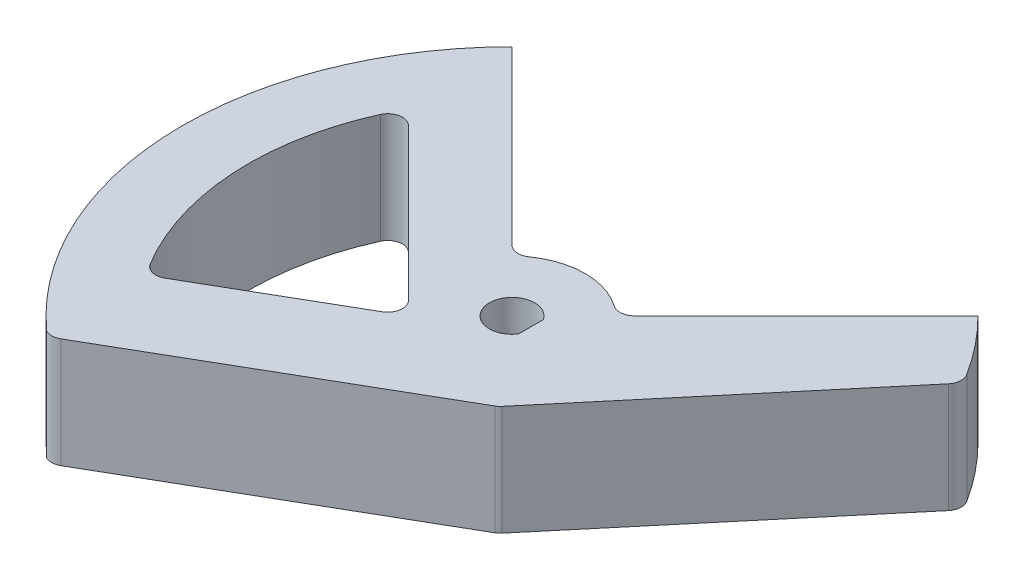
ISO-10303-21;
HEADER;
FILE_DESCRIPTION(('STEP AP214'),'2;1');
FILE_NAME('part.step','',(''),(''),'','','');
FILE_SCHEMA(('AUTOMOTIVE_DESIGN { 1 0 10303 214 1 1 1 1 }'));
ENDSEC;
DATA;
#1=APPLICATION_CONTEXT('core data for automotive mechanical design processes');
#2=APPLICATION_PROTOCOL_DEFINITION('international standard','automotive_design',2000,#1);
#3=PRODUCT_CONTEXT('',#1,'mechanical');
#4=PRODUCT('Part','Part','',(#3));
#5=PRODUCT_RELATED_PRODUCT_CATEGORY('part','',(#4));
#6=PRODUCT_DEFINITION_FORMATION('','',#4);
#7=PRODUCT_DEFINITION_CONTEXT('part definition',#1,'design');
#8=PRODUCT_DEFINITION('design','',#6,#7);
#9=PRODUCT_DEFINITION_SHAPE('','',#8);
#10=(LENGTH_UNIT() NAMED_UNIT(*) SI_UNIT(.MILLI.,.METRE.));
#11=(NAMED_UNIT(*) PLANE_ANGLE_UNIT() SI_UNIT($,.RADIAN.));
#12=(NAMED_UNIT(*) SI_UNIT($,.STERADIAN.) SOLID_ANGLE_UNIT());
#13=UNCERTAINTY_MEASURE_WITH_UNIT(LENGTH_MEASURE(1.E-05),#10,'distance_accuracy_value','');
#14=(GEOMETRIC_REPRESENTATION_CONTEXT(3) GLOBAL_UNCERTAINTY_ASSIGNED_CONTEXT((#13)) GLOBAL_UNIT_ASSIGNED_CONTEXT((#10,
#11,#12)) REPRESENTATION_CONTEXT('',''));
#15=CARTESIAN_POINT('',(0.,0.,0.));
#16=DIRECTION('',(0.,0.,1.));
#17=DIRECTION('',(1.,0.,0.));
#18=AXIS2_PLACEMENT_3D('',#15,#16,#17);
#19=CARTESIAN_POINT('',(0.,15.,0.));
#20=DIRECTION('',(0.,-1.,0.));
#21=DIRECTION('',(0.,0.,-1.));
#22=AXIS2_PLACEMENT_3D('',#19,#20,#21);
#23=CYLINDRICAL_SURFACE('',#22,45.);
#24=CARTESIAN_POINT('',(0.,0.,0.));
#25=DIRECTION('',(0.,1.,0.));
#26=DIRECTION('',(0.,0.,1.));
#27=AXIS2_PLACEMENT_3D('',#24,#25,#26);
#28=CIRCLE('',#27,45.);
#29=CARTESIAN_POINT('',(-31.8198051533945,0.,-31.8198051533948));
#30=VERTEX_POINT('',#29);
#31=CARTESIAN_POINT('',(-29.9623039946305,0.,33.5746979038285));
#32=VERTEX_POINT('',#31);
#33=EDGE_CURVE('E248',#30,#32,#28,.T.);
#34=ORIENTED_EDGE('',*,*,#33,.T.);
#35=DIRECTION('',(0.,-1.,0.));
#36=VECTOR('',#35,1.);
#37=CARTESIAN_POINT('',(-29.9623039946305,15.,33.5746979038285));
#38=LINE('',#37,#36);
#39=CARTESIAN_POINT('',(-29.9623039946305,15.,33.5746979038285));
#40=VERTEX_POINT('',#39);
#41=EDGE_CURVE('E258',#32,#40,#38,.F.);
#42=ORIENTED_EDGE('',*,*,#41,.T.);
#43=CARTESIAN_POINT('',(0.,15.,0.));
#44=DIRECTION('',(0.,1.,0.));
#45=DIRECTION('',(0.,0.,1.));
#46=AXIS2_PLACEMENT_3D('',#43,#44,#45);
#47=CIRCLE('',#46,45.);
#48=CARTESIAN_POINT('',(-31.8198051533945,15.,-31.8198051533948));
#49=VERTEX_POINT('',#48);
#50=EDGE_CURVE('E236',#49,#40,#47,.T.);
#51=ORIENTED_EDGE('',*,*,#50,.F.);
#52=DIRECTION('',(0.,-1.,0.));
#53=VECTOR('',#52,1.);
#54=CARTESIAN_POINT('',(-31.8198051533945,15.,-31.8198051533948));
#55=LINE('',#54,#53);
#56=EDGE_CURVE('E255',#49,#30,#55,.T.);
#57=ORIENTED_EDGE('',*,*,#56,.T.);
#58=EDGE_LOOP('',(#34,#42,#51,#57));
#59=FACE_BOUND('',#58,.T.);
#60=ADVANCED_FACE('F37',(#59),#23,.T.);
#61=CARTESIAN_POINT('',(0.,15.,0.));
#62=DIRECTION('',(0.,1.,0.));
#63=DIRECTION('',(0.,0.,1.));
#64=AXIS2_PLACEMENT_3D('',#61,#62,#63);
#65=PLANE('',#64);
#66=DIRECTION('',(-0.866025403784441,0.,0.499999999999995));
#67=VECTOR('',#66,1.);
#68=CARTESIAN_POINT('',(-29.5123039946306,15.,34.3541207672345));
#69=LINE('',#68,#67);
#70=CARTESIAN_POINT('',(9.49381264003777,15.,11.8339288281671));
#71=VERTEX_POINT('',#70);
#72=CARTESIAN_POINT('',(-28.0657563804816,15.,33.51895611281));
#73=VERTEX_POINT('',#72);
#74=EDGE_CURVE('E219',#71,#73,#69,.T.);
#75=ORIENTED_EDGE('',*,*,#74,.F.);
#76=CARTESIAN_POINT('',(8.49381264003777,15.,10.1018780205982));
#77=DIRECTION('',(0.,1.,0.));
#78=DIRECTION('',(0.,0.,1.));
#79=AXIS2_PLACEMENT_3D('',#76,#77,#78);
#80=CIRCLE('',#79,2.);
#81=CARTESIAN_POINT('',(10.0259015262757,15.,11.3874532399713));
#82=VERTEX_POINT('',#81);
#83=EDGE_CURVE('E280',#71,#82,#80,.T.);
#84=ORIENTED_EDGE('',*,*,#83,.T.);
#85=DIRECTION('',(-0.64278760968654,0.,0.766044443118977));
#86=VECTOR('',#85,1.);
#87=CARTESIAN_POINT('',(11.4906666467847,15.,9.64181414529811));
#88=LINE('',#87,#86);
#89=CARTESIAN_POINT('',(37.837118604492,15.,-21.7566646274103));
#90=VERTEX_POINT('',#89);
#91=EDGE_CURVE('E222',#90,#82,#88,.T.);
#92=ORIENTED_EDGE('',*,*,#91,.F.);
#93=CARTESIAN_POINT('',(36.305029718254,15.,-23.0422398467834));
#94=DIRECTION('',(0.,1.,0.));
#95=DIRECTION('',(0.,0.,1.));
#96=AXIS2_PLACEMENT_3D('',#93,#94,#95);
#97=CIRCLE('',#96,2.);
#98=CARTESIAN_POINT('',(37.9936357516612,15.,-24.1139719326803));
#99=VERTEX_POINT('',#98);
#100=EDGE_CURVE('E278',#90,#99,#97,.T.);
#101=ORIENTED_EDGE('',*,*,#100,.T.);
#102=CARTESIAN_POINT('',(31.8198051533948,15.,-31.8198051533945));
#103=VERTEX_POINT('',#102);
#104=EDGE_CURVE('E235',#99,#103,#47,.T.);
#105=ORIENTED_EDGE('',*,*,#104,.T.);
#106=DIRECTION('',(-0.707106781186551,0.,0.707106781186544));
#107=VECTOR('',#106,1.);
#108=CARTESIAN_POINT('',(7.07106781186551,15.,-7.07106781186544));
#109=LINE('',#108,#107);
#110=CARTESIAN_POINT('',(8.3666002653408,15.,-8.36660026534071));
#111=VERTEX_POINT('',#110);
#112=EDGE_CURVE('E239',#103,#111,#109,.T.);
#113=ORIENTED_EDGE('',*,*,#112,.T.);
#114=CARTESIAN_POINT('',(6.95238670296771,15.,-9.78081382771382));
#115=DIRECTION('',(0.,1.,0.));
#116=DIRECTION('',(0.,0.,1.));
#117=AXIS2_PLACEMENT_3D('',#114,#115,#116);
#118=CIRCLE('',#117,2.);
#119=CARTESIAN_POINT('',(5.79365558580642,15.,-8.15067818976151));
#120=VERTEX_POINT('',#119);
#121=EDGE_CURVE('E11',#111,#120,#118,.F.);
#122=ORIENTED_EDGE('',*,*,#121,.T.);
#123=CARTESIAN_POINT('',(0.,15.,0.));
#124=DIRECTION('',(0.,1.,0.));
#125=DIRECTION('',(0.,0.,1.));
#126=AXIS2_PLACEMENT_3D('',#123,#124,#125);
#127=CIRCLE('',#126,10.);
#128=CARTESIAN_POINT('',(-5.79365558580635,15.,-8.15067818976157));
#129=VERTEX_POINT('',#128);
#130=EDGE_CURVE('E229',#120,#129,#127,.T.);
#131=ORIENTED_EDGE('',*,*,#130,.T.);
#132=CARTESIAN_POINT('',(-6.95238670296762,15.,-9.78081382771388));
#133=DIRECTION('',(0.,1.,0.));
#134=DIRECTION('',(0.,0.,1.));
#135=AXIS2_PLACEMENT_3D('',#132,#133,#134);
#136=CIRCLE('',#135,2.);
#137=CARTESIAN_POINT('',(-8.36660026534072,15.,-8.3666002653408));
#138=VERTEX_POINT('',#137);
#139=EDGE_CURVE('E321',#129,#138,#136,.F.);
#140=ORIENTED_EDGE('',*,*,#139,.T.);
#141=DIRECTION('',(-0.707106781186544,0.,-0.707106781186551));
#142=VECTOR('',#141,1.);
#143=CARTESIAN_POINT('',(-31.8198051533945,15.,-31.8198051533948));
#144=LINE('',#143,#142);
#145=EDGE_CURVE('E232',#138,#49,#144,.T.);
#146=ORIENTED_EDGE('',*,*,#145,.T.);
#147=ORIENTED_EDGE('',*,*,#50,.T.);
#148=CARTESIAN_POINT('',(-29.0657563804816,15.,31.7869053052411));
#149=DIRECTION('',(0.,1.,0.));
#150=DIRECTION('',(0.,0.,1.));
#151=AXIS2_PLACEMENT_3D('',#148,#149,#150);
#152=CIRCLE('',#151,2.);
#153=EDGE_CURVE('E276',#40,#73,#152,.T.);
#154=ORIENTED_EDGE('',*,*,#153,.T.);
#155=EDGE_LOOP('',(#75,#84,#92,#101,#105,#113,#122,#131,#140,#146,#147,#154));
#156=FACE_BOUND('',#155,.T.);
#157=CARTESIAN_POINT('',(0.,15.,0.));
#158=DIRECTION('',(0.,1.,0.));
#159=DIRECTION('',(0.,0.,1.));
#160=AXIS2_PLACEMENT_3D('',#157,#158,#159);
#161=CIRCLE('',#160,3.09);
#162=CARTESIAN_POINT('',(2.59,15.,-1.68522995463527));
#163=VERTEX_POINT('',#162);
#164=CARTESIAN_POINT('',(2.59,15.,1.68522995463527));
#165=VERTEX_POINT('',#164);
#166=EDGE_CURVE('E181',#163,#165,#161,.T.);
#167=ORIENTED_EDGE('',*,*,#166,.F.);
#168=DIRECTION('',(0.,0.,-1.));
#169=VECTOR('',#168,1.);
#170=CARTESIAN_POINT('',(2.59,15.,-1.68522995463527));
#171=LINE('',#170,#169);
#172=EDGE_CURVE('E194',#165,#163,#171,.T.);
#173=ORIENTED_EDGE('',*,*,#172,.F.);
#174=EDGE_LOOP('',(#167,#173));
#175=FACE_BOUND('',#174,.T.);
#176=CARTESIAN_POINT('',(0.,15.,0.));
#177=DIRECTION('',(0.,1.,0.));
#178=DIRECTION('',(0.,0.,1.));
#179=AXIS2_PLACEMENT_3D('',#176,#177,#178);
#180=CIRCLE('',#179,36.);
#181=CARTESIAN_POINT('',(-32.8020619051509,15.,-14.8332307597046));
#182=VERTEX_POINT('',#181);
#183=CARTESIAN_POINT('',(-30.8608539245713,15.,18.5366581412689));
#184=VERTEX_POINT('',#183);
#185=EDGE_CURVE('E199',#182,#184,#180,.T.);
#186=ORIENTED_EDGE('',*,*,#185,.F.);
#187=CARTESIAN_POINT('',(-30.9797251326425,15.,-14.0091623841655));
#188=DIRECTION('',(0.,1.,0.));
#189=DIRECTION('',(0.,0.,1.));
#190=AXIS2_PLACEMENT_3D('',#187,#188,#189);
#191=CIRCLE('',#190,2.);
#192=CARTESIAN_POINT('',(-29.5655115702694,15.,-15.4233759465386));
#193=VERTEX_POINT('',#192);
#194=EDGE_CURVE('E312',#182,#193,#191,.F.);
#195=ORIENTED_EDGE('',*,*,#194,.T.);
#196=DIRECTION('',(0.707106781186548,0.,0.707106781186547));
#197=VECTOR('',#196,1.);
#198=CARTESIAN_POINT('',(-31.5251063331404,15.,-17.3829707094095));
#199=LINE('',#198,#197);
#200=CARTESIAN_POINT('',(-8.9141068089662,15.,5.22802881476468));
#201=VERTEX_POINT('',#200);
#202=EDGE_CURVE('E205',#193,#201,#199,.T.);
#203=ORIENTED_EDGE('',*,*,#202,.T.);
#204=CARTESIAN_POINT('',(-10.3283203713393,15.,6.64224237713777));
#205=DIRECTION('',(0.,1.,0.));
#206=DIRECTION('',(0.,0.,1.));
#207=AXIS2_PLACEMENT_3D('',#204,#205,#206);
#208=CIRCLE('',#207,2.);
#209=CARTESIAN_POINT('',(-9.3283203713393,15.,8.37429318470665));
#210=VERTEX_POINT('',#209);
#211=EDGE_CURVE('E60',#201,#210,#208,.F.);
#212=ORIENTED_EDGE('',*,*,#211,.T.);
#213=DIRECTION('',(-0.866025403784439,0.,0.5));
#214=VECTOR('',#213,1.);
#215=CARTESIAN_POINT('',(-7.07106781186544,15.,7.07106781186544));
#216=LINE('',#215,#214);
#217=CARTESIAN_POINT('',(-28.1463620398729,15.,19.2388946076561));
#218=VERTEX_POINT('',#217);
#219=EDGE_CURVE('E214',#210,#218,#216,.T.);
#220=ORIENTED_EDGE('',*,*,#219,.T.);
#221=CARTESIAN_POINT('',(-29.1463620398729,15.,17.5068438000873));
#222=DIRECTION('',(0.,1.,0.));
#223=DIRECTION('',(0.,0.,1.));
#224=AXIS2_PLACEMENT_3D('',#221,#222,#223);
#225=CIRCLE('',#224,2.);
#226=EDGE_CURVE('E52',#218,#184,#225,.F.);
#227=ORIENTED_EDGE('',*,*,#226,.T.);
#228=EDGE_LOOP('',(#186,#195,#203,#212,#220,#227));
#229=FACE_BOUND('',#228,.T.);
#230=ADVANCED_FACE('F337',(#156,#175,#229),#65,.T.);
#231=CARTESIAN_POINT('',(0.,0.,0.));
#232=DIRECTION('',(0.,1.,0.));
#233=DIRECTION('',(0.,0.,1.));
#234=AXIS2_PLACEMENT_3D('',#231,#232,#233);
#235=PLANE('',#234);
#236=DIRECTION('',(0.,0.,-1.));
#237=VECTOR('',#236,1.);
#238=CARTESIAN_POINT('',(2.59,0.,-1.68522995463527));
#239=LINE('',#238,#237);
#240=CARTESIAN_POINT('',(2.59,0.,1.68522995463527));
#241=VERTEX_POINT('',#240);
#242=CARTESIAN_POINT('',(2.59,0.,-1.68522995463527));
#243=VERTEX_POINT('',#242);
#244=EDGE_CURVE('E186',#241,#243,#239,.T.);
#245=ORIENTED_EDGE('',*,*,#244,.T.);
#246=CARTESIAN_POINT('',(0.,0.,0.));
#247=DIRECTION('',(0.,1.,0.));
#248=DIRECTION('',(0.,0.,1.));
#249=AXIS2_PLACEMENT_3D('',#246,#247,#248);
#250=CIRCLE('',#249,3.09);
#251=EDGE_CURVE('E178',#243,#241,#250,.T.);
#252=ORIENTED_EDGE('',*,*,#251,.T.);
#253=EDGE_LOOP('',(#245,#252));
#254=FACE_BOUND('',#253,.T.);
#255=DIRECTION('',(0.707106781186548,0.,0.707106781186547));
#256=VECTOR('',#255,1.);
#257=CARTESIAN_POINT('',(-31.5251063331404,0.,-17.3829707094095));
#258=LINE('',#257,#256);
#259=CARTESIAN_POINT('',(-29.5655115702694,0.,-15.4233759465386));
#260=VERTEX_POINT('',#259);
#261=CARTESIAN_POINT('',(-8.9141068089662,0.,5.22802881476468));
#262=VERTEX_POINT('',#261);
#263=EDGE_CURVE('E208',#260,#262,#258,.T.);
#264=ORIENTED_EDGE('',*,*,#263,.F.);
#265=CARTESIAN_POINT('',(-30.9797251326425,0.,-14.0091623841655));
#266=DIRECTION('',(0.,1.,0.));
#267=DIRECTION('',(0.,0.,1.));
#268=AXIS2_PLACEMENT_3D('',#265,#266,#267);
#269=CIRCLE('',#268,2.);
#270=CARTESIAN_POINT('',(-32.8020619051509,0.,-14.8332307597046));
#271=VERTEX_POINT('',#270);
#272=EDGE_CURVE('E314',#260,#271,#269,.T.);
#273=ORIENTED_EDGE('',*,*,#272,.T.);
#274=CARTESIAN_POINT('',(0.,0.,0.));
#275=DIRECTION('',(0.,1.,0.));
#276=DIRECTION('',(0.,0.,1.));
#277=AXIS2_PLACEMENT_3D('',#274,#275,#276);
#278=CIRCLE('',#277,36.);
#279=CARTESIAN_POINT('',(-30.8608539245713,0.,18.5366581412689));
#280=VERTEX_POINT('',#279);
#281=EDGE_CURVE('E201',#271,#280,#278,.T.);
#282=ORIENTED_EDGE('',*,*,#281,.T.);
#283=CARTESIAN_POINT('',(-29.1463620398729,0.,17.5068438000873));
#284=DIRECTION('',(0.,1.,0.));
#285=DIRECTION('',(0.,0.,1.));
#286=AXIS2_PLACEMENT_3D('',#283,#284,#285);
#287=CIRCLE('',#286,2.);
#288=CARTESIAN_POINT('',(-28.1463620398729,0.,19.2388946076561));
#289=VERTEX_POINT('',#288);
#290=EDGE_CURVE('E310',#280,#289,#287,.T.);
#291=ORIENTED_EDGE('',*,*,#290,.T.);
#292=DIRECTION('',(-0.866025403784439,0.,0.5));
#293=VECTOR('',#292,1.);
#294=CARTESIAN_POINT('',(-7.07106781186544,0.,7.07106781186544));
#295=LINE('',#294,#293);
#296=CARTESIAN_POINT('',(-9.3283203713393,0.,8.37429318470665));
#297=VERTEX_POINT('',#296);
#298=EDGE_CURVE('E204',#297,#289,#295,.T.);
#299=ORIENTED_EDGE('',*,*,#298,.F.);
#300=CARTESIAN_POINT('',(-10.3283203713393,0.,6.64224237713777));
#301=DIRECTION('',(0.,1.,0.));
#302=DIRECTION('',(0.,0.,1.));
#303=AXIS2_PLACEMENT_3D('',#300,#301,#302);
#304=CIRCLE('',#303,2.);
#305=EDGE_CURVE('E317',#297,#262,#304,.T.);
#306=ORIENTED_EDGE('',*,*,#305,.T.);
#307=EDGE_LOOP('',(#264,#273,#282,#291,#299,#306));
#308=FACE_BOUND('',#307,.T.);
#309=DIRECTION('',(-0.64278760968654,0.,0.766044443118977));
#310=VECTOR('',#309,1.);
#311=CARTESIAN_POINT('',(11.4906666467847,0.,9.64181414529811));
#312=LINE('',#311,#310);
#313=CARTESIAN_POINT('',(37.837118604492,0.,-21.7566646274103));
#314=VERTEX_POINT('',#313);
#315=CARTESIAN_POINT('',(10.0259015262757,0.,11.3874532399713));
#316=VERTEX_POINT('',#315);
#317=EDGE_CURVE('E223',#314,#316,#312,.T.);
#318=ORIENTED_EDGE('',*,*,#317,.T.);
#319=CARTESIAN_POINT('',(8.49381264003777,0.,10.1018780205982));
#320=DIRECTION('',(0.,1.,0.));
#321=DIRECTION('',(0.,0.,1.));
#322=AXIS2_PLACEMENT_3D('',#319,#320,#321);
#323=CIRCLE('',#322,2.);
#324=CARTESIAN_POINT('',(9.49381264003777,0.,11.8339288281671));
#325=VERTEX_POINT('',#324);
#326=EDGE_CURVE('E269',#316,#325,#323,.F.);
#327=ORIENTED_EDGE('',*,*,#326,.T.);
#328=DIRECTION('',(0.866025403784441,0.,-0.499999999999995));
#329=VECTOR('',#328,1.);
#330=CARTESIAN_POINT('',(-29.5123039946306,0.,34.3541207672345));
#331=LINE('',#330,#329);
#332=CARTESIAN_POINT('',(-28.0657563804816,0.,33.51895611281));
#333=VERTEX_POINT('',#332);
#334=EDGE_CURVE('E211',#333,#325,#331,.T.);
#335=ORIENTED_EDGE('',*,*,#334,.F.);
#336=CARTESIAN_POINT('',(-29.0657563804816,0.,31.7869053052411));
#337=DIRECTION('',(0.,1.,0.));
#338=DIRECTION('',(0.,0.,1.));
#339=AXIS2_PLACEMENT_3D('',#336,#337,#338);
#340=CIRCLE('',#339,2.);
#341=EDGE_CURVE('E265',#333,#32,#340,.F.);
#342=ORIENTED_EDGE('',*,*,#341,.T.);
#343=ORIENTED_EDGE('',*,*,#33,.F.);
#344=DIRECTION('',(-0.707106781186544,0.,-0.707106781186551));
#345=VECTOR('',#344,1.);
#346=CARTESIAN_POINT('',(-31.8198051533945,0.,-31.8198051533948));
#347=LINE('',#346,#345);
#348=CARTESIAN_POINT('',(-8.36660026534072,0.,-8.3666002653408));
#349=VERTEX_POINT('',#348);
#350=EDGE_CURVE('E245',#349,#30,#347,.T.);
#351=ORIENTED_EDGE('',*,*,#350,.F.);
#352=CARTESIAN_POINT('',(-6.95238670296762,0.,-9.78081382771388));
#353=DIRECTION('',(0.,1.,0.));
#354=DIRECTION('',(0.,0.,1.));
#355=AXIS2_PLACEMENT_3D('',#352,#353,#354);
#356=CIRCLE('',#355,2.);
#357=CARTESIAN_POINT('',(-5.79365558580635,0.,-8.15067818976157));
#358=VERTEX_POINT('',#357);
#359=EDGE_CURVE('E319',#349,#358,#356,.T.);
#360=ORIENTED_EDGE('',*,*,#359,.T.);
#361=CARTESIAN_POINT('',(0.,0.,0.));
#362=DIRECTION('',(0.,1.,0.));
#363=DIRECTION('',(0.,0.,1.));
#364=AXIS2_PLACEMENT_3D('',#361,#362,#363);
#365=CIRCLE('',#364,10.);
#366=CARTESIAN_POINT('',(5.79365558580642,0.,-8.15067818976151));
#367=VERTEX_POINT('',#366);
#368=EDGE_CURVE('E226',#367,#358,#365,.T.);
#369=ORIENTED_EDGE('',*,*,#368,.F.);
#370=CARTESIAN_POINT('',(6.95238670296771,0.,-9.78081382771382));
#371=DIRECTION('',(0.,1.,0.));
#372=DIRECTION('',(0.,0.,1.));
#373=AXIS2_PLACEMENT_3D('',#370,#371,#372);
#374=CIRCLE('',#373,2.);
#375=CARTESIAN_POINT('',(8.3666002653408,0.,-8.36660026534071));
#376=VERTEX_POINT('',#375);
#377=EDGE_CURVE('E45',#367,#376,#374,.T.);
#378=ORIENTED_EDGE('',*,*,#377,.T.);
#379=DIRECTION('',(-0.707106781186551,0.,0.707106781186544));
#380=VECTOR('',#379,1.);
#381=CARTESIAN_POINT('',(7.07106781186551,0.,-7.07106781186544));
#382=LINE('',#381,#380);
#383=CARTESIAN_POINT('',(31.8198051533948,0.,-31.8198051533945));
#384=VERTEX_POINT('',#383);
#385=EDGE_CURVE('E233',#384,#376,#382,.T.);
#386=ORIENTED_EDGE('',*,*,#385,.F.);
#387=CARTESIAN_POINT('',(37.9936357516612,0.,-24.1139719326803));
#388=VERTEX_POINT('',#387);
#389=EDGE_CURVE('E247',#388,#384,#28,.T.);
#390=ORIENTED_EDGE('',*,*,#389,.F.);
#391=CARTESIAN_POINT('',(36.305029718254,0.,-23.0422398467834));
#392=DIRECTION('',(0.,1.,0.));
#393=DIRECTION('',(0.,0.,1.));
#394=AXIS2_PLACEMENT_3D('',#391,#392,#393);
#395=CIRCLE('',#394,2.);
#396=EDGE_CURVE('E267',#388,#314,#395,.F.);
#397=ORIENTED_EDGE('',*,*,#396,.T.);
#398=EDGE_LOOP('',(#318,#327,#335,#342,#343,#351,#360,#369,#378,#386,#390,#397));
#399=FACE_BOUND('',#398,.T.);
#400=ADVANCED_FACE('F192',(#254,#308,#399),#235,.F.);
#401=CARTESIAN_POINT('',(0.,15.,0.));
#402=DIRECTION('',(0.,-1.,0.));
#403=DIRECTION('',(0.,0.,-1.));
#404=AXIS2_PLACEMENT_3D('',#401,#402,#403);
#405=CYLINDRICAL_SURFACE('',#404,10.);
#406=ORIENTED_EDGE('',*,*,#368,.T.);
#407=DIRECTION('',(0.,-1.,0.));
#408=VECTOR('',#407,1.);
#409=CARTESIAN_POINT('',(-5.79365558580635,15.,-8.15067818976157));
#410=LINE('',#409,#408);
#411=EDGE_CURVE('E305',#358,#129,#410,.F.);
#412=ORIENTED_EDGE('',*,*,#411,.T.);
#413=ORIENTED_EDGE('',*,*,#130,.F.);
#414=DIRECTION('',(0.,-1.,0.));
#415=VECTOR('',#414,1.);
#416=CARTESIAN_POINT('',(5.79365558580642,15.,-8.15067818976152));
#417=LINE('',#416,#415);
#418=EDGE_CURVE('E302',#120,#367,#417,.T.);
#419=ORIENTED_EDGE('',*,*,#418,.T.);
#420=EDGE_LOOP('',(#406,#412,#413,#419));
#421=FACE_BOUND('',#420,.T.);
#422=ADVANCED_FACE('F341',(#421),#405,.T.);
#423=CARTESIAN_POINT('',(-31.8198051533945,15.,-31.8198051533948));
#424=DIRECTION('',(-0.707106781186551,0.,0.707106781186544));
#425=DIRECTION('',(0.707106781186544,0.,0.707106781186551));
#426=AXIS2_PLACEMENT_3D('',#423,#424,#425);
#427=PLANE('',#426);
#428=ORIENTED_EDGE('',*,*,#145,.F.);
#429=DIRECTION('',(0.,1.,0.));
#430=VECTOR('',#429,1.);
#431=CARTESIAN_POINT('',(-8.36660026534072,0.,-8.36660026534079));
#432=LINE('',#431,#430);
#433=EDGE_CURVE('E299',#138,#349,#432,.F.);
#434=ORIENTED_EDGE('',*,*,#433,.T.);
#435=ORIENTED_EDGE('',*,*,#350,.T.);
#436=ORIENTED_EDGE('',*,*,#56,.F.);
#437=EDGE_LOOP('',(#428,#434,#435,#436));
#438=FACE_BOUND('',#437,.T.);
#439=ADVANCED_FACE('F349',(#438),#427,.F.);
#440=ORIENTED_EDGE('',*,*,#104,.F.);
#441=DIRECTION('',(0.,-1.,0.));
#442=VECTOR('',#441,1.);
#443=CARTESIAN_POINT('',(37.9936357516612,15.,-24.1139719326803));
#444=LINE('',#443,#442);
#445=EDGE_CURVE('E282',#99,#388,#444,.T.);
#446=ORIENTED_EDGE('',*,*,#445,.T.);
#447=ORIENTED_EDGE('',*,*,#389,.T.);
#448=DIRECTION('',(0.,-1.,0.));
#449=VECTOR('',#448,1.);
#450=CARTESIAN_POINT('',(31.8198051533948,15.,-31.8198051533945));
#451=LINE('',#450,#449);
#452=EDGE_CURVE('E242',#103,#384,#451,.T.);
#453=ORIENTED_EDGE('',*,*,#452,.F.);
#454=EDGE_LOOP('',(#440,#446,#447,#453));
#455=FACE_BOUND('',#454,.T.);
#456=ADVANCED_FACE('F378',(#455),#23,.T.);
#457=CARTESIAN_POINT('',(7.07106781186551,15.,-7.07106781186544));
#458=DIRECTION('',(0.707106781186544,0.,0.707106781186551));
#459=DIRECTION('',(0.707106781186551,0.,-0.707106781186544));
#460=AXIS2_PLACEMENT_3D('',#457,#458,#459);
#461=PLANE('',#460);
#462=ORIENTED_EDGE('',*,*,#385,.T.);
#463=DIRECTION('',(0.,1.,0.));
#464=VECTOR('',#463,1.);
#465=CARTESIAN_POINT('',(8.3666002653408,15.,-8.36660026534071));
#466=LINE('',#465,#464);
#467=EDGE_CURVE('E307',#376,#111,#466,.T.);
#468=ORIENTED_EDGE('',*,*,#467,.T.);
#469=ORIENTED_EDGE('',*,*,#112,.F.);
#470=ORIENTED_EDGE('',*,*,#452,.T.);
#471=EDGE_LOOP('',(#462,#468,#469,#470));
#472=FACE_BOUND('',#471,.T.);
#473=ADVANCED_FACE('F330',(#472),#461,.F.);
#474=CARTESIAN_POINT('',(11.4906666467847,0.,9.64181414529811));
#475=DIRECTION('',(-0.766044443118977,0.,-0.64278760968654));
#476=DIRECTION('',(-0.64278760968654,0.,0.766044443118977));
#477=AXIS2_PLACEMENT_3D('',#474,#475,#476);
#478=PLANE('',#477);
#479=ORIENTED_EDGE('',*,*,#91,.T.);
#480=DIRECTION('',(0.,-1.,0.));
#481=VECTOR('',#480,1.);
#482=CARTESIAN_POINT('',(10.0259015262757,0.,11.3874532399713));
#483=LINE('',#482,#481);
#484=EDGE_CURVE('E262',#82,#316,#483,.T.);
#485=ORIENTED_EDGE('',*,*,#484,.T.);
#486=ORIENTED_EDGE('',*,*,#317,.F.);
#487=DIRECTION('',(0.,-1.,0.));
#488=VECTOR('',#487,1.);
#489=CARTESIAN_POINT('',(37.837118604492,0.,-21.7566646274103));
#490=LINE('',#489,#488);
#491=EDGE_CURVE('E260',#314,#90,#490,.F.);
#492=ORIENTED_EDGE('',*,*,#491,.T.);
#493=EDGE_LOOP('',(#479,#485,#486,#492));
#494=FACE_BOUND('',#493,.T.);
#495=ADVANCED_FACE('F369',(#494),#478,.F.);
#496=CARTESIAN_POINT('',(7.49769465589423,0.,12.9863880836466));
#497=DIRECTION('',(0.499999999999995,0.,0.866025403784441));
#498=DIRECTION('',(0.866025403784441,0.,-0.499999999999995));
#499=AXIS2_PLACEMENT_3D('',#496,#497,#498);
#500=PLANE('',#499);
#501=ORIENTED_EDGE('',*,*,#334,.T.);
#502=DIRECTION('',(0.,-1.,0.));
#503=VECTOR('',#502,1.);
#504=CARTESIAN_POINT('',(9.49381264003776,15.,11.8339288281671));
#505=LINE('',#504,#503);
#506=EDGE_CURVE('E274',#325,#71,#505,.F.);
#507=ORIENTED_EDGE('',*,*,#506,.T.);
#508=ORIENTED_EDGE('',*,*,#74,.T.);
#509=DIRECTION('',(0.,1.,0.));
#510=VECTOR('',#509,1.);
#511=CARTESIAN_POINT('',(-28.0657563804816,0.,33.51895611281));
#512=LINE('',#511,#510);
#513=EDGE_CURVE('E271',#73,#333,#512,.F.);
#514=ORIENTED_EDGE('',*,*,#513,.T.);
#515=EDGE_LOOP('',(#501,#507,#508,#514));
#516=FACE_BOUND('',#515,.T.);
#517=ADVANCED_FACE('F361',(#516),#500,.T.);
#518=CARTESIAN_POINT('',(0.,0.,0.));
#519=DIRECTION('',(0.,1.,0.));
#520=DIRECTION('',(0.,0.,1.));
#521=AXIS2_PLACEMENT_3D('',#518,#519,#520);
#522=CYLINDRICAL_SURFACE('',#521,36.);
#523=ORIENTED_EDGE('',*,*,#185,.T.);
#524=DIRECTION('',(0.,1.,0.));
#525=VECTOR('',#524,1.);
#526=CARTESIAN_POINT('',(-30.8608539245714,0.,18.5366581412689));
#527=LINE('',#526,#525);
#528=EDGE_CURVE('E292',#184,#280,#527,.F.);
#529=ORIENTED_EDGE('',*,*,#528,.T.);
#530=ORIENTED_EDGE('',*,*,#281,.F.);
#531=DIRECTION('',(0.,1.,0.));
#532=VECTOR('',#531,1.);
#533=CARTESIAN_POINT('',(-32.8020619051509,0.,-14.8332307597046));
#534=LINE('',#533,#532);
#535=EDGE_CURVE('E289',#271,#182,#534,.T.);
#536=ORIENTED_EDGE('',*,*,#535,.T.);
#537=EDGE_LOOP('',(#523,#529,#530,#536));
#538=FACE_BOUND('',#537,.T.);
#539=ADVANCED_FACE('F401',(#538),#522,.F.);
#540=CARTESIAN_POINT('',(-31.5251063331404,0.,-17.3829707094095));
#541=DIRECTION('',(-0.707106781186547,0.,0.707106781186548));
#542=DIRECTION('',(0.707106781186548,0.,0.707106781186547));
#543=AXIS2_PLACEMENT_3D('',#540,#541,#542);
#544=PLANE('',#543);
#545=ORIENTED_EDGE('',*,*,#202,.F.);
#546=DIRECTION('',(0.,1.,0.));
#547=VECTOR('',#546,1.);
#548=CARTESIAN_POINT('',(-29.5655115702694,0.,-15.4233759465386));
#549=LINE('',#548,#547);
#550=EDGE_CURVE('E297',#193,#260,#549,.F.);
#551=ORIENTED_EDGE('',*,*,#550,.T.);
#552=ORIENTED_EDGE('',*,*,#263,.T.);
#553=DIRECTION('',(0.,1.,0.));
#554=VECTOR('',#553,1.);
#555=CARTESIAN_POINT('',(-8.9141068089662,15.,5.22802881476467));
#556=LINE('',#555,#554);
#557=EDGE_CURVE('E294',#262,#201,#556,.T.);
#558=ORIENTED_EDGE('',*,*,#557,.T.);
#559=EDGE_LOOP('',(#545,#551,#552,#558));
#560=FACE_BOUND('',#559,.T.);
#561=ADVANCED_FACE('F404',(#560),#544,.T.);
#562=CARTESIAN_POINT('',(-7.07106781186544,0.,7.07106781186544));
#563=DIRECTION('',(-0.5,0.,-0.866025403784439));
#564=DIRECTION('',(-0.866025403784439,0.,0.5));
#565=AXIS2_PLACEMENT_3D('',#562,#563,#564);
#566=PLANE('',#565);
#567=ORIENTED_EDGE('',*,*,#298,.T.);
#568=DIRECTION('',(0.,1.,0.));
#569=VECTOR('',#568,1.);
#570=CARTESIAN_POINT('',(-28.1463620398729,0.,19.2388946076561));
#571=LINE('',#570,#569);
#572=EDGE_CURVE('E287',#289,#218,#571,.T.);
#573=ORIENTED_EDGE('',*,*,#572,.T.);
#574=ORIENTED_EDGE('',*,*,#219,.F.);
#575=DIRECTION('',(0.,1.,0.));
#576=VECTOR('',#575,1.);
#577=CARTESIAN_POINT('',(-9.3283203713393,0.,8.37429318470664));
#578=LINE('',#577,#576);
#579=EDGE_CURVE('E285',#210,#297,#578,.F.);
#580=ORIENTED_EDGE('',*,*,#579,.T.);
#581=EDGE_LOOP('',(#567,#573,#574,#580));
#582=FACE_BOUND('',#581,.T.);
#583=ADVANCED_FACE('F406',(#582),#566,.T.);
#584=CARTESIAN_POINT('',(0.,0.,0.));
#585=DIRECTION('',(0.,1.,0.));
#586=DIRECTION('',(0.,0.,1.));
#587=AXIS2_PLACEMENT_3D('',#584,#585,#586);
#588=CYLINDRICAL_SURFACE('',#587,3.09);
#589=ORIENTED_EDGE('',*,*,#166,.T.);
#590=DIRECTION('',(0.,1.,0.));
#591=VECTOR('',#590,1.);
#592=CARTESIAN_POINT('',(2.59,0.,1.68522995463527));
#593=LINE('',#592,#591);
#594=EDGE_CURVE('E174',#241,#165,#593,.T.);
#595=ORIENTED_EDGE('',*,*,#594,.F.);
#596=ORIENTED_EDGE('',*,*,#251,.F.);
#597=DIRECTION('',(0.,1.,0.));
#598=VECTOR('',#597,1.);
#599=CARTESIAN_POINT('',(2.59,0.,-1.68522995463527));
#600=LINE('',#599,#598);
#601=EDGE_CURVE('E185',#243,#163,#600,.T.);
#602=ORIENTED_EDGE('',*,*,#601,.T.);
#603=EDGE_LOOP('',(#589,#595,#596,#602));
#604=FACE_BOUND('',#603,.T.);
#605=ADVANCED_FACE('F176',(#604),#588,.F.);
#606=CARTESIAN_POINT('',(2.59,0.,-1.68522995463527));
#607=DIRECTION('',(1.,0.,0.));
#608=DIRECTION('',(0.,0.,-1.));
#609=AXIS2_PLACEMENT_3D('',#606,#607,#608);
#610=PLANE('',#609);
#611=ORIENTED_EDGE('',*,*,#172,.T.);
#612=ORIENTED_EDGE('',*,*,#601,.F.);
#613=ORIENTED_EDGE('',*,*,#244,.F.);
#614=ORIENTED_EDGE('',*,*,#594,.T.);
#615=EDGE_LOOP('',(#611,#612,#613,#614));
#616=FACE_BOUND('',#615,.T.);
#617=ADVANCED_FACE('F189',(#616),#610,.F.);
#618=CARTESIAN_POINT('',(8.49381264003777,0.,10.1018780205982));
#619=DIRECTION('',(0.,1.,0.));
#620=DIRECTION('',(0.,0.,1.));
#621=AXIS2_PLACEMENT_3D('',#618,#619,#620);
#622=CYLINDRICAL_SURFACE('',#621,2.);
#623=ORIENTED_EDGE('',*,*,#83,.F.);
#624=ORIENTED_EDGE('',*,*,#506,.F.);
#625=ORIENTED_EDGE('',*,*,#326,.F.);
#626=ORIENTED_EDGE('',*,*,#484,.F.);
#627=EDGE_LOOP('',(#623,#624,#625,#626));
#628=FACE_BOUND('',#627,.T.);
#629=ADVANCED_FACE('F367',(#628),#622,.T.);
#630=CARTESIAN_POINT('',(36.305029718254,15.,-23.0422398467834));
#631=DIRECTION('',(0.,-1.,0.));
#632=DIRECTION('',(0.,0.,-1.));
#633=AXIS2_PLACEMENT_3D('',#630,#631,#632);
#634=CYLINDRICAL_SURFACE('',#633,2.);
#635=ORIENTED_EDGE('',*,*,#100,.F.);
#636=ORIENTED_EDGE('',*,*,#491,.F.);
#637=ORIENTED_EDGE('',*,*,#396,.F.);
#638=ORIENTED_EDGE('',*,*,#445,.F.);
#639=EDGE_LOOP('',(#635,#636,#637,#638));
#640=FACE_BOUND('',#639,.T.);
#641=ADVANCED_FACE('F376',(#640),#634,.T.);
#642=CARTESIAN_POINT('',(-29.0657563804816,15.,31.7869053052411));
#643=DIRECTION('',(0.,-1.,0.));
#644=DIRECTION('',(0.,0.,-1.));
#645=AXIS2_PLACEMENT_3D('',#642,#643,#644);
#646=CYLINDRICAL_SURFACE('',#645,2.);
#647=ORIENTED_EDGE('',*,*,#153,.F.);
#648=ORIENTED_EDGE('',*,*,#41,.F.);
#649=ORIENTED_EDGE('',*,*,#341,.F.);
#650=ORIENTED_EDGE('',*,*,#513,.F.);
#651=EDGE_LOOP('',(#647,#648,#649,#650));
#652=FACE_BOUND('',#651,.T.);
#653=ADVANCED_FACE('F358',(#652),#646,.T.);
#654=CARTESIAN_POINT('',(-29.1463620398729,0.,17.5068438000873));
#655=DIRECTION('',(0.,1.,0.));
#656=DIRECTION('',(0.,0.,1.));
#657=AXIS2_PLACEMENT_3D('',#654,#655,#656);
#658=CYLINDRICAL_SURFACE('',#657,2.);
#659=ORIENTED_EDGE('',*,*,#290,.F.);
#660=ORIENTED_EDGE('',*,*,#528,.F.);
#661=ORIENTED_EDGE('',*,*,#226,.F.);
#662=ORIENTED_EDGE('',*,*,#572,.F.);
#663=EDGE_LOOP('',(#659,#660,#661,#662));
#664=FACE_BOUND('',#663,.T.);
#665=ADVANCED_FACE('F428',(#664),#658,.F.);
#666=CARTESIAN_POINT('',(-30.9797251326425,0.,-14.0091623841655));
#667=DIRECTION('',(0.,1.,0.));
#668=DIRECTION('',(0.,0.,1.));
#669=AXIS2_PLACEMENT_3D('',#666,#667,#668);
#670=CYLINDRICAL_SURFACE('',#669,2.);
#671=ORIENTED_EDGE('',*,*,#272,.F.);
#672=ORIENTED_EDGE('',*,*,#550,.F.);
#673=ORIENTED_EDGE('',*,*,#194,.F.);
#674=ORIENTED_EDGE('',*,*,#535,.F.);
#675=EDGE_LOOP('',(#671,#672,#673,#674));
#676=FACE_BOUND('',#675,.T.);
#677=ADVANCED_FACE('F431',(#676),#670,.F.);
#678=CARTESIAN_POINT('',(-10.3283203713393,0.,6.64224237713777));
#679=DIRECTION('',(0.,-1.,0.));
#680=DIRECTION('',(0.,0.,-1.));
#681=AXIS2_PLACEMENT_3D('',#678,#679,#680);
#682=CYLINDRICAL_SURFACE('',#681,2.);
#683=ORIENTED_EDGE('',*,*,#305,.F.);
#684=ORIENTED_EDGE('',*,*,#579,.F.);
#685=ORIENTED_EDGE('',*,*,#211,.F.);
#686=ORIENTED_EDGE('',*,*,#557,.F.);
#687=EDGE_LOOP('',(#683,#684,#685,#686));
#688=FACE_BOUND('',#687,.T.);
#689=ADVANCED_FACE('F434',(#688),#682,.F.);
#690=CARTESIAN_POINT('',(-6.95238670296762,15.,-9.78081382771388));
#691=DIRECTION('',(0.,-1.,0.));
#692=DIRECTION('',(0.,0.,-1.));
#693=AXIS2_PLACEMENT_3D('',#690,#691,#692);
#694=CYLINDRICAL_SURFACE('',#693,2.);
#695=ORIENTED_EDGE('',*,*,#139,.F.);
#696=ORIENTED_EDGE('',*,*,#411,.F.);
#697=ORIENTED_EDGE('',*,*,#359,.F.);
#698=ORIENTED_EDGE('',*,*,#433,.F.);
#699=EDGE_LOOP('',(#695,#696,#697,#698));
#700=FACE_BOUND('',#699,.T.);
#701=ADVANCED_FACE('F344',(#700),#694,.F.);
#702=CARTESIAN_POINT('',(6.95238670296771,15.,-9.78081382771382));
#703=DIRECTION('',(0.,-1.,0.));
#704=DIRECTION('',(0.,0.,-1.));
#705=AXIS2_PLACEMENT_3D('',#702,#703,#704);
#706=CYLINDRICAL_SURFACE('',#705,2.);
#707=ORIENTED_EDGE('',*,*,#121,.F.);
#708=ORIENTED_EDGE('',*,*,#467,.F.);
#709=ORIENTED_EDGE('',*,*,#377,.F.);
#710=ORIENTED_EDGE('',*,*,#418,.F.);
#711=EDGE_LOOP('',(#707,#708,#709,#710));
#712=FACE_BOUND('',#711,.T.);
#713=ADVANCED_FACE('F39',(#712),#706,.F.);
#714=CLOSED_SHELL('',(#60,#230,#400,#422,#439,#456,#473,#495,#517,#539,#561,#583,#605,#617,#629,
#641,#653,#665,#677,#689,#701,#713));
#715=MANIFOLD_SOLID_BREP('B2',#714);
#716=ADVANCED_BREP_SHAPE_REPRESENTATION('',(#18,#715),#14);
#717=SHAPE_DEFINITION_REPRESENTATION(#9,#716);
ENDSEC;
END-ISO-10303-21;
